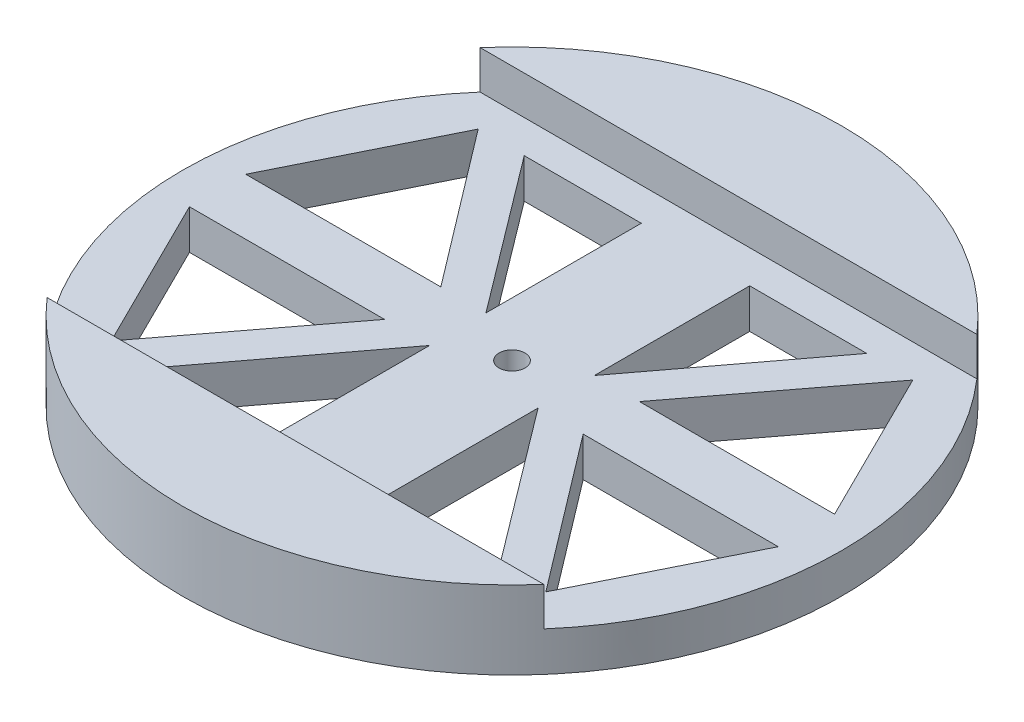
ISO-10303-21;
HEADER;
FILE_DESCRIPTION(('STEP AP214'),'2;1');
FILE_NAME('part.step','',(''),(''),'','','');
FILE_SCHEMA(('AUTOMOTIVE_DESIGN { 1 0 10303 214 1 1 1 1 }'));
ENDSEC;
DATA;
#1=APPLICATION_CONTEXT('core data for automotive mechanical design processes');
#2=APPLICATION_PROTOCOL_DEFINITION('international standard','automotive_design',2000,#1);
#3=PRODUCT_CONTEXT('',#1,'mechanical');
#4=PRODUCT('Part','Part','',(#3));
#5=PRODUCT_RELATED_PRODUCT_CATEGORY('part','',(#4));
#6=PRODUCT_DEFINITION_FORMATION('','',#4);
#7=PRODUCT_DEFINITION_CONTEXT('part definition',#1,'design');
#8=PRODUCT_DEFINITION('design','',#6,#7);
#9=PRODUCT_DEFINITION_SHAPE('','',#8);
#10=(LENGTH_UNIT() NAMED_UNIT(*) SI_UNIT(.MILLI.,.METRE.));
#11=(NAMED_UNIT(*) PLANE_ANGLE_UNIT() SI_UNIT($,.RADIAN.));
#12=(NAMED_UNIT(*) SI_UNIT($,.STERADIAN.) SOLID_ANGLE_UNIT());
#13=UNCERTAINTY_MEASURE_WITH_UNIT(LENGTH_MEASURE(1.E-05),#10,'distance_accuracy_value','');
#14=(GEOMETRIC_REPRESENTATION_CONTEXT(3) GLOBAL_UNCERTAINTY_ASSIGNED_CONTEXT((#13)) GLOBAL_UNIT_ASSIGNED_CONTEXT((#10,
#11,#12)) REPRESENTATION_CONTEXT('',''));
#15=CARTESIAN_POINT('',(0.,0.,0.));
#16=DIRECTION('',(0.,0.,1.));
#17=DIRECTION('',(1.,0.,0.));
#18=AXIS2_PLACEMENT_3D('',#15,#16,#17);
#19=CARTESIAN_POINT('',(0.,18.,0.));
#20=DIRECTION('',(0.,1.,0.));
#21=DIRECTION('',(0.,0.,1.));
#22=AXIS2_PLACEMENT_3D('',#19,#20,#21);
#23=PLANE('',#22);
#24=DIRECTION('',(-1.,0.,0.));
#25=VECTOR('',#24,1.);
#26=CARTESIAN_POINT('',(0.,18.,-49.9317963849467));
#27=LINE('',#26,#25);
#28=CARTESIAN_POINT('',(57.2958611923429,18.,-49.9317963849467));
#29=VERTEX_POINT('',#28);
#30=CARTESIAN_POINT('',(-57.2958611923429,18.,-49.9317963849467));
#31=VERTEX_POINT('',#30);
#32=EDGE_CURVE('E452',#29,#31,#27,.T.);
#33=ORIENTED_EDGE('',*,*,#32,.F.);
#34=CARTESIAN_POINT('',(0.,18.,0.));
#35=DIRECTION('',(0.,1.,0.));
#36=DIRECTION('',(0.,0.,1.));
#37=AXIS2_PLACEMENT_3D('',#34,#35,#36);
#38=CIRCLE('',#37,76.);
#39=EDGE_CURVE('E448',#29,#31,#38,.T.);
#40=ORIENTED_EDGE('',*,*,#39,.T.);
#41=EDGE_LOOP('',(#33,#40));
#42=FACE_BOUND('',#41,.T.);
#43=ADVANCED_FACE('F40',(#42),#23,.T.);
#44=CARTESIAN_POINT('',(0.,18.,0.));
#45=DIRECTION('',(0.,-1.,0.));
#46=DIRECTION('',(0.,0.,-1.));
#47=AXIS2_PLACEMENT_3D('',#44,#45,#46);
#48=CYLINDRICAL_SURFACE('',#47,76.);
#49=ORIENTED_EDGE('',*,*,#39,.F.);
#50=DIRECTION('',(0.,-1.,0.));
#51=VECTOR('',#50,1.);
#52=CARTESIAN_POINT('',(57.2958611923429,18.,-49.9317963849467));
#53=LINE('',#52,#51);
#54=CARTESIAN_POINT('',(57.2958611923429,9.11,-49.9317963849467));
#55=VERTEX_POINT('',#54);
#56=EDGE_CURVE('E441',#29,#55,#53,.T.);
#57=ORIENTED_EDGE('',*,*,#56,.T.);
#58=CARTESIAN_POINT('',(0.,9.11,0.));
#59=DIRECTION('',(0.,1.,0.));
#60=DIRECTION('',(0.,0.,1.));
#61=AXIS2_PLACEMENT_3D('',#58,#59,#60);
#62=CIRCLE('',#61,76.);
#63=CARTESIAN_POINT('',(57.2958611923429,9.11,49.9317963849467));
#64=VERTEX_POINT('',#63);
#65=EDGE_CURVE('E11',#64,#55,#62,.T.);
#66=ORIENTED_EDGE('',*,*,#65,.F.);
#67=DIRECTION('',(0.,-1.,0.));
#68=VECTOR('',#67,1.);
#69=CARTESIAN_POINT('',(57.2958611923429,18.,49.9317963849467));
#70=LINE('',#69,#68);
#71=CARTESIAN_POINT('',(57.2958611923429,18.,49.9317963849467));
#72=VERTEX_POINT('',#71);
#73=EDGE_CURVE('E432',#64,#72,#70,.F.);
#74=ORIENTED_EDGE('',*,*,#73,.T.);
#75=CARTESIAN_POINT('',(-57.2958611923429,18.,49.9317963849467));
#76=VERTEX_POINT('',#75);
#77=EDGE_CURVE('E445',#76,#72,#38,.T.);
#78=ORIENTED_EDGE('',*,*,#77,.F.);
#79=DIRECTION('',(0.,-1.,0.));
#80=VECTOR('',#79,1.);
#81=CARTESIAN_POINT('',(-57.2958611923429,18.,49.9317963849467));
#82=LINE('',#81,#80);
#83=CARTESIAN_POINT('',(-57.2958611923429,9.11,49.9317963849467));
#84=VERTEX_POINT('',#83);
#85=EDGE_CURVE('E435',#76,#84,#82,.T.);
#86=ORIENTED_EDGE('',*,*,#85,.T.);
#87=CARTESIAN_POINT('',(-57.2958611923429,9.11,-49.9317963849467));
#88=VERTEX_POINT('',#87);
#89=EDGE_CURVE('E44',#88,#84,#62,.T.);
#90=ORIENTED_EDGE('',*,*,#89,.F.);
#91=DIRECTION('',(0.,-1.,0.));
#92=VECTOR('',#91,1.);
#93=CARTESIAN_POINT('',(-57.2958611923429,18.,-49.9317963849467));
#94=LINE('',#93,#92);
#95=EDGE_CURVE('E438',#88,#31,#94,.F.);
#96=ORIENTED_EDGE('',*,*,#95,.T.);
#97=EDGE_LOOP('',(#49,#57,#66,#74,#78,#86,#90,#96));
#98=FACE_BOUND('',#97,.T.);
#99=CARTESIAN_POINT('',(0.,0.,0.));
#100=DIRECTION('',(0.,1.,0.));
#101=DIRECTION('',(0.,0.,1.));
#102=AXIS2_PLACEMENT_3D('',#99,#100,#101);
#103=CIRCLE('',#102,76.);
#104=CARTESIAN_POINT('',(0.,0.,76.));
#105=VERTEX_POINT('',#104);
#106=EDGE_CURVE('E444',#105,#105,#103,.T.);
#107=ORIENTED_EDGE('',*,*,#106,.T.);
#108=EDGE_LOOP('',(#107));
#109=FACE_BOUND('',#108,.T.);
#110=ADVANCED_FACE('F42',(#98,#109),#48,.T.);
#111=DIRECTION('',(1.,0.,0.));
#112=VECTOR('',#111,1.);
#113=CARTESIAN_POINT('',(0.,18.,49.9317963849467));
#114=LINE('',#113,#112);
#115=EDGE_CURVE('E451',#76,#72,#114,.T.);
#116=ORIENTED_EDGE('',*,*,#115,.F.);
#117=ORIENTED_EDGE('',*,*,#77,.T.);
#118=EDGE_LOOP('',(#116,#117));
#119=FACE_BOUND('',#118,.T.);
#120=ADVANCED_FACE('F468',(#119),#23,.T.);
#121=CARTESIAN_POINT('',(0.,0.,0.));
#122=DIRECTION('',(0.,1.,0.));
#123=DIRECTION('',(0.,0.,1.));
#124=AXIS2_PLACEMENT_3D('',#121,#122,#123);
#125=PLANE('',#124);
#126=DIRECTION('',(1.,0.,0.));
#127=VECTOR('',#126,1.);
#128=CARTESIAN_POINT('',(-12.5,0.,42.3228493227827));
#129=LINE('',#128,#127);
#130=CARTESIAN_POINT('',(-39.5,0.,42.3228493227827));
#131=VERTEX_POINT('',#130);
#132=CARTESIAN_POINT('',(-12.5,0.,42.3228493227827));
#133=VERTEX_POINT('',#132);
#134=EDGE_CURVE('E55',#131,#133,#129,.T.);
#135=ORIENTED_EDGE('',*,*,#134,.T.);
#136=DIRECTION('',(0.,0.,-1.));
#137=VECTOR('',#136,1.);
#138=CARTESIAN_POINT('',(-12.5,0.,6.49059266367805));
#139=LINE('',#138,#137);
#140=CARTESIAN_POINT('',(-12.5,0.,6.49059266367805));
#141=VERTEX_POINT('',#140);
#142=EDGE_CURVE('E293',#133,#141,#139,.T.);
#143=ORIENTED_EDGE('',*,*,#142,.T.);
#144=DIRECTION('',(-0.601793099843737,0.,0.798652029973296));
#145=VECTOR('',#144,1.);
#146=CARTESIAN_POINT('',(-12.5,0.,6.49059266367805));
#147=LINE('',#146,#145);
#148=EDGE_CURVE('E298',#141,#131,#147,.T.);
#149=ORIENTED_EDGE('',*,*,#148,.T.);
#150=EDGE_LOOP('',(#135,#143,#149));
#151=FACE_BOUND('',#150,.T.);
#152=DIRECTION('',(1.,0.,0.));
#153=VECTOR('',#152,1.);
#154=CARTESIAN_POINT('',(12.5,0.,42.3228493227827));
#155=LINE('',#154,#153);
#156=CARTESIAN_POINT('',(12.5,0.,42.3228493227827));
#157=VERTEX_POINT('',#156);
#158=CARTESIAN_POINT('',(39.5,0.,42.3228493227827));
#159=VERTEX_POINT('',#158);
#160=EDGE_CURVE('E63',#157,#159,#155,.T.);
#161=ORIENTED_EDGE('',*,*,#160,.T.);
#162=DIRECTION('',(-0.601793099843737,0.,-0.798652029973296));
#163=VECTOR('',#162,1.);
#164=CARTESIAN_POINT('',(12.5,0.,6.49059266367805));
#165=LINE('',#164,#163);
#166=CARTESIAN_POINT('',(12.5,0.,6.49059266367805));
#167=VERTEX_POINT('',#166);
#168=EDGE_CURVE('E272',#159,#167,#165,.T.);
#169=ORIENTED_EDGE('',*,*,#168,.T.);
#170=DIRECTION('',(0.,0.,1.));
#171=VECTOR('',#170,1.);
#172=CARTESIAN_POINT('',(12.5,0.,6.49059266367805));
#173=LINE('',#172,#171);
#174=EDGE_CURVE('E277',#167,#157,#173,.T.);
#175=ORIENTED_EDGE('',*,*,#174,.T.);
#176=EDGE_LOOP('',(#161,#169,#175));
#177=FACE_BOUND('',#176,.T.);
#178=DIRECTION('',(-1.,0.,0.));
#179=VECTOR('',#178,1.);
#180=CARTESIAN_POINT('',(12.5,0.,-42.3228493227827));
#181=LINE('',#180,#179);
#182=CARTESIAN_POINT('',(39.5,0.,-42.3228493227827));
#183=VERTEX_POINT('',#182);
#184=CARTESIAN_POINT('',(12.5,0.,-42.3228493227827));
#185=VERTEX_POINT('',#184);
#186=EDGE_CURVE('E253',#183,#185,#181,.T.);
#187=ORIENTED_EDGE('',*,*,#186,.T.);
#188=DIRECTION('',(0.,0.,1.));
#189=VECTOR('',#188,1.);
#190=CARTESIAN_POINT('',(12.5,0.,-6.49059266367805));
#191=LINE('',#190,#189);
#192=CARTESIAN_POINT('',(12.5,0.,-6.49059266367805));
#193=VERTEX_POINT('',#192);
#194=EDGE_CURVE('E230',#185,#193,#191,.T.);
#195=ORIENTED_EDGE('',*,*,#194,.T.);
#196=DIRECTION('',(0.601793099843737,0.,-0.798652029973296));
#197=VECTOR('',#196,1.);
#198=CARTESIAN_POINT('',(12.5,0.,-6.49059266367805));
#199=LINE('',#198,#197);
#200=EDGE_CURVE('E255',#193,#183,#199,.T.);
#201=ORIENTED_EDGE('',*,*,#200,.T.);
#202=EDGE_LOOP('',(#187,#195,#201));
#203=FACE_BOUND('',#202,.T.);
#204=DIRECTION('',(-1.,0.,0.));
#205=VECTOR('',#204,1.);
#206=CARTESIAN_POINT('',(-12.5,0.,-42.3228493227827));
#207=LINE('',#206,#205);
#208=CARTESIAN_POINT('',(-12.5,0.,-42.3228493227827));
#209=VERTEX_POINT('',#208);
#210=CARTESIAN_POINT('',(-39.5,0.,-42.3228493227827));
#211=VERTEX_POINT('',#210);
#212=EDGE_CURVE('E310',#209,#211,#207,.T.);
#213=ORIENTED_EDGE('',*,*,#212,.T.);
#214=DIRECTION('',(0.601793099843737,0.,0.798652029973296));
#215=VECTOR('',#214,1.);
#216=CARTESIAN_POINT('',(-12.5,0.,-6.49059266367805));
#217=LINE('',#216,#215);
#218=CARTESIAN_POINT('',(-12.5,0.,-6.49059266367805));
#219=VERTEX_POINT('',#218);
#220=EDGE_CURVE('E303',#211,#219,#217,.T.);
#221=ORIENTED_EDGE('',*,*,#220,.T.);
#222=DIRECTION('',(0.,0.,-1.));
#223=VECTOR('',#222,1.);
#224=CARTESIAN_POINT('',(-12.5,0.,-6.49059266367805));
#225=LINE('',#224,#223);
#226=EDGE_CURVE('E306',#219,#209,#225,.T.);
#227=ORIENTED_EDGE('',*,*,#226,.T.);
#228=EDGE_LOOP('',(#213,#221,#227));
#229=FACE_BOUND('',#228,.T.);
#230=DIRECTION('',(-1.,0.,0.));
#231=VECTOR('',#230,1.);
#232=CARTESIAN_POINT('',(-67.902913425769,0.,6.49059266367802));
#233=LINE('',#232,#231);
#234=CARTESIAN_POINT('',(-22.902913425769,0.,6.49059266367803));
#235=VERTEX_POINT('',#234);
#236=CARTESIAN_POINT('',(-67.902913425769,0.,6.49059266367802));
#237=VERTEX_POINT('',#236);
#238=EDGE_CURVE('E378',#235,#237,#233,.T.);
#239=ORIENTED_EDGE('',*,*,#238,.T.);
#240=DIRECTION('',(0.444444444444444,0.,0.895806416477617));
#241=VECTOR('',#240,1.);
#242=CARTESIAN_POINT('',(-50.1251356479912,0.,42.3228493227827));
#243=LINE('',#242,#241);
#244=CARTESIAN_POINT('',(-50.1251356479912,0.,42.3228493227827));
#245=VERTEX_POINT('',#244);
#246=EDGE_CURVE('E386',#237,#245,#243,.T.);
#247=ORIENTED_EDGE('',*,*,#246,.T.);
#248=DIRECTION('',(0.604938271604938,0.,-0.796272370202326));
#249=VECTOR('',#248,1.);
#250=CARTESIAN_POINT('',(-22.902913425769,0.,6.49059266367803));
#251=LINE('',#250,#249);
#252=EDGE_CURVE('E392',#245,#235,#251,.T.);
#253=ORIENTED_EDGE('',*,*,#252,.T.);
#254=EDGE_LOOP('',(#239,#247,#253));
#255=FACE_BOUND('',#254,.T.);
#256=DIRECTION('',(-1.,0.,0.));
#257=VECTOR('',#256,1.);
#258=CARTESIAN_POINT('',(67.902913425769,0.,6.49059266367803));
#259=LINE('',#258,#257);
#260=CARTESIAN_POINT('',(67.9029134257689,0.,6.49059266367804));
#261=VERTEX_POINT('',#260);
#262=CARTESIAN_POINT('',(22.902913425769,0.,6.49059266367804));
#263=VERTEX_POINT('',#262);
#264=EDGE_CURVE('E354',#261,#263,#259,.T.);
#265=ORIENTED_EDGE('',*,*,#264,.T.);
#266=DIRECTION('',(0.604938271604938,0.,0.796272370202326));
#267=VECTOR('',#266,1.);
#268=CARTESIAN_POINT('',(22.902913425769,0.,6.49059266367804));
#269=LINE('',#268,#267);
#270=CARTESIAN_POINT('',(50.1251356479912,0.,42.3228493227827));
#271=VERTEX_POINT('',#270);
#272=EDGE_CURVE('E364',#263,#271,#269,.T.);
#273=ORIENTED_EDGE('',*,*,#272,.T.);
#274=DIRECTION('',(0.444444444444444,0.,-0.895806416477617));
#275=VECTOR('',#274,1.);
#276=CARTESIAN_POINT('',(50.1251356479912,0.,42.3228493227827));
#277=LINE('',#276,#275);
#278=EDGE_CURVE('E370',#271,#261,#277,.T.);
#279=ORIENTED_EDGE('',*,*,#278,.T.);
#280=EDGE_LOOP('',(#265,#273,#279));
#281=FACE_BOUND('',#280,.T.);
#282=DIRECTION('',(1.,0.,0.));
#283=VECTOR('',#282,1.);
#284=CARTESIAN_POINT('',(67.902913425769,0.,-6.49059266367803));
#285=LINE('',#284,#283);
#286=CARTESIAN_POINT('',(22.902913425769,0.,-6.49059266367804));
#287=VERTEX_POINT('',#286);
#288=CARTESIAN_POINT('',(67.902913425769,0.,-6.49059266367803));
#289=VERTEX_POINT('',#288);
#290=EDGE_CURVE('E328',#287,#289,#285,.T.);
#291=ORIENTED_EDGE('',*,*,#290,.T.);
#292=DIRECTION('',(-0.444444444444444,0.,-0.895806416477617));
#293=VECTOR('',#292,1.);
#294=CARTESIAN_POINT('',(50.1251356479912,0.,-42.3228493227827));
#295=LINE('',#294,#293);
#296=CARTESIAN_POINT('',(50.1251356479912,0.,-42.3228493227827));
#297=VERTEX_POINT('',#296);
#298=EDGE_CURVE('E338',#289,#297,#295,.T.);
#299=ORIENTED_EDGE('',*,*,#298,.T.);
#300=DIRECTION('',(-0.604938271604938,0.,0.796272370202326));
#301=VECTOR('',#300,1.);
#302=CARTESIAN_POINT('',(22.902913425769,0.,-6.49059266367804));
#303=LINE('',#302,#301);
#304=EDGE_CURVE('E346',#297,#287,#303,.T.);
#305=ORIENTED_EDGE('',*,*,#304,.T.);
#306=EDGE_LOOP('',(#291,#299,#305));
#307=FACE_BOUND('',#306,.T.);
#308=DIRECTION('',(1.,0.,0.));
#309=VECTOR('',#308,1.);
#310=CARTESIAN_POINT('',(-67.902913425769,0.,-6.49059266367803));
#311=LINE('',#310,#309);
#312=CARTESIAN_POINT('',(-67.902913425769,0.,-6.49059266367803));
#313=VERTEX_POINT('',#312);
#314=CARTESIAN_POINT('',(-22.902913425769,0.,-6.49059266367803));
#315=VERTEX_POINT('',#314);
#316=EDGE_CURVE('E404',#313,#315,#311,.T.);
#317=ORIENTED_EDGE('',*,*,#316,.T.);
#318=DIRECTION('',(-0.604938271604938,0.,-0.796272370202326));
#319=VECTOR('',#318,1.);
#320=CARTESIAN_POINT('',(-22.902913425769,0.,-6.49059266367803));
#321=LINE('',#320,#319);
#322=CARTESIAN_POINT('',(-50.1251356479912,0.,-42.3228493227827));
#323=VERTEX_POINT('',#322);
#324=EDGE_CURVE('E397',#315,#323,#321,.T.);
#325=ORIENTED_EDGE('',*,*,#324,.T.);
#326=DIRECTION('',(-0.444444444444444,0.,0.895806416477617));
#327=VECTOR('',#326,1.);
#328=CARTESIAN_POINT('',(-50.1251356479912,0.,-42.3228493227827));
#329=LINE('',#328,#327);
#330=EDGE_CURVE('E400',#323,#313,#329,.T.);
#331=ORIENTED_EDGE('',*,*,#330,.T.);
#332=EDGE_LOOP('',(#317,#325,#331));
#333=FACE_BOUND('',#332,.T.);
#334=CARTESIAN_POINT('',(0.,0.,0.));
#335=DIRECTION('',(0.,1.,0.));
#336=DIRECTION('',(0.,0.,1.));
#337=AXIS2_PLACEMENT_3D('',#334,#335,#336);
#338=CIRCLE('',#337,3.);
#339=CARTESIAN_POINT('',(0.,0.,3.));
#340=VERTEX_POINT('',#339);
#341=EDGE_CURVE('E423',#340,#340,#338,.T.);
#342=ORIENTED_EDGE('',*,*,#341,.T.);
#343=EDGE_LOOP('',(#342));
#344=FACE_BOUND('',#343,.T.);
#345=ORIENTED_EDGE('',*,*,#106,.F.);
#346=EDGE_LOOP('',(#345));
#347=FACE_BOUND('',#346,.T.);
#348=ADVANCED_FACE('F470',(#151,#177,#203,#229,#255,#281,#307,#333,#344,#347),#125,.F.);
#349=CARTESIAN_POINT('',(-58.0079555223723,9.11,0.));
#350=DIRECTION('',(0.,1.,0.));
#351=DIRECTION('',(0.,0.,1.));
#352=AXIS2_PLACEMENT_3D('',#349,#350,#351);
#353=PLANE('',#352);
#354=DIRECTION('',(0.,0.,-1.));
#355=VECTOR('',#354,1.);
#356=CARTESIAN_POINT('',(-12.5,9.11,6.49059266367805));
#357=LINE('',#356,#355);
#358=CARTESIAN_POINT('',(-12.5,9.11,42.3228493227827));
#359=VERTEX_POINT('',#358);
#360=CARTESIAN_POINT('',(-12.5,9.11,6.49059266367805));
#361=VERTEX_POINT('',#360);
#362=EDGE_CURVE('E267',#359,#361,#357,.T.);
#363=ORIENTED_EDGE('',*,*,#362,.F.);
#364=DIRECTION('',(1.,0.,0.));
#365=VECTOR('',#364,1.);
#366=CARTESIAN_POINT('',(-12.5,9.11,42.3228493227827));
#367=LINE('',#366,#365);
#368=CARTESIAN_POINT('',(-39.5,9.11,42.3228493227827));
#369=VERTEX_POINT('',#368);
#370=EDGE_CURVE('E289',#369,#359,#367,.T.);
#371=ORIENTED_EDGE('',*,*,#370,.F.);
#372=DIRECTION('',(-0.601793099843737,0.,0.798652029973296));
#373=VECTOR('',#372,1.);
#374=CARTESIAN_POINT('',(-12.5,9.11,6.49059266367805));
#375=LINE('',#374,#373);
#376=EDGE_CURVE('E292',#361,#369,#375,.T.);
#377=ORIENTED_EDGE('',*,*,#376,.F.);
#378=EDGE_LOOP('',(#363,#371,#377));
#379=FACE_BOUND('',#378,.T.);
#380=DIRECTION('',(-0.601793099843737,0.,-0.798652029973296));
#381=VECTOR('',#380,1.);
#382=CARTESIAN_POINT('',(12.5,9.11,6.49059266367805));
#383=LINE('',#382,#381);
#384=CARTESIAN_POINT('',(39.5,9.11,42.3228493227827));
#385=VERTEX_POINT('',#384);
#386=CARTESIAN_POINT('',(12.5,9.11,6.49059266367805));
#387=VERTEX_POINT('',#386);
#388=EDGE_CURVE('E234',#385,#387,#383,.T.);
#389=ORIENTED_EDGE('',*,*,#388,.F.);
#390=DIRECTION('',(1.,0.,0.));
#391=VECTOR('',#390,1.);
#392=CARTESIAN_POINT('',(12.5,9.11,42.3228493227827));
#393=LINE('',#392,#391);
#394=CARTESIAN_POINT('',(12.5,9.11,42.3228493227827));
#395=VERTEX_POINT('',#394);
#396=EDGE_CURVE('E268',#395,#385,#393,.T.);
#397=ORIENTED_EDGE('',*,*,#396,.F.);
#398=DIRECTION('',(0.,0.,1.));
#399=VECTOR('',#398,1.);
#400=CARTESIAN_POINT('',(12.5,9.11,6.49059266367805));
#401=LINE('',#400,#399);
#402=EDGE_CURVE('E271',#387,#395,#401,.T.);
#403=ORIENTED_EDGE('',*,*,#402,.F.);
#404=EDGE_LOOP('',(#389,#397,#403));
#405=FACE_BOUND('',#404,.T.);
#406=DIRECTION('',(0.,0.,1.));
#407=VECTOR('',#406,1.);
#408=CARTESIAN_POINT('',(12.5,9.11,-6.49059266367805));
#409=LINE('',#408,#407);
#410=CARTESIAN_POINT('',(12.5,9.11,-42.3228493227827));
#411=VERTEX_POINT('',#410);
#412=CARTESIAN_POINT('',(12.5,9.11,-6.49059266367805));
#413=VERTEX_POINT('',#412);
#414=EDGE_CURVE('E227',#411,#413,#409,.T.);
#415=ORIENTED_EDGE('',*,*,#414,.F.);
#416=DIRECTION('',(-1.,0.,0.));
#417=VECTOR('',#416,1.);
#418=CARTESIAN_POINT('',(12.5,9.11,-42.3228493227827));
#419=LINE('',#418,#417);
#420=CARTESIAN_POINT('',(39.5,9.11,-42.3228493227827));
#421=VERTEX_POINT('',#420);
#422=EDGE_CURVE('E237',#421,#411,#419,.T.);
#423=ORIENTED_EDGE('',*,*,#422,.F.);
#424=DIRECTION('',(0.601793099843737,0.,-0.798652029973296));
#425=VECTOR('',#424,1.);
#426=CARTESIAN_POINT('',(12.5,9.11,-6.49059266367805));
#427=LINE('',#426,#425);
#428=EDGE_CURVE('E243',#413,#421,#427,.T.);
#429=ORIENTED_EDGE('',*,*,#428,.F.);
#430=EDGE_LOOP('',(#415,#423,#429));
#431=FACE_BOUND('',#430,.T.);
#432=DIRECTION('',(0.601793099843737,0.,0.798652029973296));
#433=VECTOR('',#432,1.);
#434=CARTESIAN_POINT('',(-12.5,9.11,-6.49059266367805));
#435=LINE('',#434,#433);
#436=CARTESIAN_POINT('',(-39.5,9.11,-42.3228493227827));
#437=VERTEX_POINT('',#436);
#438=CARTESIAN_POINT('',(-12.5,9.11,-6.49059266367805));
#439=VERTEX_POINT('',#438);
#440=EDGE_CURVE('E247',#437,#439,#435,.T.);
#441=ORIENTED_EDGE('',*,*,#440,.F.);
#442=DIRECTION('',(-1.,0.,0.));
#443=VECTOR('',#442,1.);
#444=CARTESIAN_POINT('',(-12.5,9.11,-42.3228493227827));
#445=LINE('',#444,#443);
#446=CARTESIAN_POINT('',(-12.5,9.11,-42.3228493227827));
#447=VERTEX_POINT('',#446);
#448=EDGE_CURVE('E307',#447,#437,#445,.T.);
#449=ORIENTED_EDGE('',*,*,#448,.F.);
#450=DIRECTION('',(0.,0.,-1.));
#451=VECTOR('',#450,1.);
#452=CARTESIAN_POINT('',(-12.5,9.11,-6.49059266367805));
#453=LINE('',#452,#451);
#454=EDGE_CURVE('E249',#439,#447,#453,.T.);
#455=ORIENTED_EDGE('',*,*,#454,.F.);
#456=EDGE_LOOP('',(#441,#449,#455));
#457=FACE_BOUND('',#456,.T.);
#458=DIRECTION('',(0.444444444444444,0.,0.895806416477617));
#459=VECTOR('',#458,1.);
#460=CARTESIAN_POINT('',(-50.1251356479912,9.11,42.3228493227827));
#461=LINE('',#460,#459);
#462=CARTESIAN_POINT('',(-67.902913425769,9.11,6.49059266367802));
#463=VERTEX_POINT('',#462);
#464=CARTESIAN_POINT('',(-50.1251356479912,9.11,42.3228493227827));
#465=VERTEX_POINT('',#464);
#466=EDGE_CURVE('E359',#463,#465,#461,.T.);
#467=ORIENTED_EDGE('',*,*,#466,.F.);
#468=DIRECTION('',(-1.,0.,0.));
#469=VECTOR('',#468,1.);
#470=CARTESIAN_POINT('',(-67.902913425769,9.11,6.49059266367802));
#471=LINE('',#470,#469);
#472=CARTESIAN_POINT('',(-22.902913425769,9.11,6.49059266367803));
#473=VERTEX_POINT('',#472);
#474=EDGE_CURVE('E382',#473,#463,#471,.T.);
#475=ORIENTED_EDGE('',*,*,#474,.F.);
#476=DIRECTION('',(0.604938271604938,0.,-0.796272370202326));
#477=VECTOR('',#476,1.);
#478=CARTESIAN_POINT('',(-22.902913425769,9.11,6.49059266367803));
#479=LINE('',#478,#477);
#480=EDGE_CURVE('E385',#465,#473,#479,.T.);
#481=ORIENTED_EDGE('',*,*,#480,.F.);
#482=EDGE_LOOP('',(#467,#475,#481));
#483=FACE_BOUND('',#482,.T.);
#484=DIRECTION('',(0.604938271604938,0.,0.796272370202326));
#485=VECTOR('',#484,1.);
#486=CARTESIAN_POINT('',(22.902913425769,9.11,6.49059266367804));
#487=LINE('',#486,#485);
#488=CARTESIAN_POINT('',(22.902913425769,9.11,6.49059266367804));
#489=VERTEX_POINT('',#488);
#490=CARTESIAN_POINT('',(50.1251356479912,9.11,42.3228493227827));
#491=VERTEX_POINT('',#490);
#492=EDGE_CURVE('E333',#489,#491,#487,.T.);
#493=ORIENTED_EDGE('',*,*,#492,.F.);
#494=DIRECTION('',(-1.,0.,0.));
#495=VECTOR('',#494,1.);
#496=CARTESIAN_POINT('',(67.902913425769,9.11,6.49059266367803));
#497=LINE('',#496,#495);
#498=CARTESIAN_POINT('',(67.902913425769,9.11,6.49059266367803));
#499=VERTEX_POINT('',#498);
#500=EDGE_CURVE('E360',#499,#489,#497,.T.);
#501=ORIENTED_EDGE('',*,*,#500,.F.);
#502=DIRECTION('',(0.444444444444444,0.,-0.895806416477617));
#503=VECTOR('',#502,1.);
#504=CARTESIAN_POINT('',(50.1251356479912,9.11,42.3228493227827));
#505=LINE('',#504,#503);
#506=EDGE_CURVE('E363',#491,#499,#505,.T.);
#507=ORIENTED_EDGE('',*,*,#506,.F.);
#508=EDGE_LOOP('',(#493,#501,#507));
#509=FACE_BOUND('',#508,.T.);
#510=DIRECTION('',(-0.444444444444444,0.,-0.895806416477617));
#511=VECTOR('',#510,1.);
#512=CARTESIAN_POINT('',(50.1251356479912,9.11,-42.3228493227827));
#513=LINE('',#512,#511);
#514=CARTESIAN_POINT('',(67.902913425769,9.11,-6.49059266367803));
#515=VERTEX_POINT('',#514);
#516=CARTESIAN_POINT('',(50.1251356479912,9.11,-42.3228493227827));
#517=VERTEX_POINT('',#516);
#518=EDGE_CURVE('E341',#515,#517,#513,.T.);
#519=ORIENTED_EDGE('',*,*,#518,.F.);
#520=DIRECTION('',(1.,0.,0.));
#521=VECTOR('',#520,1.);
#522=CARTESIAN_POINT('',(67.902913425769,9.11,-6.49059266367803));
#523=LINE('',#522,#521);
#524=CARTESIAN_POINT('',(22.902913425769,9.11,-6.49059266367804));
#525=VERTEX_POINT('',#524);
#526=EDGE_CURVE('E334',#525,#515,#523,.T.);
#527=ORIENTED_EDGE('',*,*,#526,.F.);
#528=DIRECTION('',(-0.604938271604938,0.,0.796272370202326));
#529=VECTOR('',#528,1.);
#530=CARTESIAN_POINT('',(22.902913425769,9.11,-6.49059266367804));
#531=LINE('',#530,#529);
#532=EDGE_CURVE('E337',#517,#525,#531,.T.);
#533=ORIENTED_EDGE('',*,*,#532,.F.);
#534=EDGE_LOOP('',(#519,#527,#533));
#535=FACE_BOUND('',#534,.T.);
#536=DIRECTION('',(-0.604938271604938,0.,-0.796272370202326));
#537=VECTOR('',#536,1.);
#538=CARTESIAN_POINT('',(-22.902913425769,9.11,-6.49059266367803));
#539=LINE('',#538,#537);
#540=CARTESIAN_POINT('',(-22.902913425769,9.11,-6.49059266367803));
#541=VERTEX_POINT('',#540);
#542=CARTESIAN_POINT('',(-50.1251356479912,9.11,-42.3228493227827));
#543=VERTEX_POINT('',#542);
#544=EDGE_CURVE('E343',#541,#543,#539,.T.);
#545=ORIENTED_EDGE('',*,*,#544,.F.);
#546=DIRECTION('',(1.,0.,0.));
#547=VECTOR('',#546,1.);
#548=CARTESIAN_POINT('',(-67.902913425769,9.11,-6.49059266367803));
#549=LINE('',#548,#547);
#550=CARTESIAN_POINT('',(-67.902913425769,9.11,-6.49059266367803));
#551=VERTEX_POINT('',#550);
#552=EDGE_CURVE('E401',#551,#541,#549,.T.);
#553=ORIENTED_EDGE('',*,*,#552,.F.);
#554=DIRECTION('',(-0.444444444444444,0.,0.895806416477617));
#555=VECTOR('',#554,1.);
#556=CARTESIAN_POINT('',(-50.1251356479912,9.11,-42.3228493227827));
#557=LINE('',#556,#555);
#558=EDGE_CURVE('E409',#543,#551,#557,.T.);
#559=ORIENTED_EDGE('',*,*,#558,.F.);
#560=EDGE_LOOP('',(#545,#553,#559));
#561=FACE_BOUND('',#560,.T.);
#562=CARTESIAN_POINT('',(0.,9.11,0.));
#563=DIRECTION('',(0.,1.,0.));
#564=DIRECTION('',(0.,0.,1.));
#565=AXIS2_PLACEMENT_3D('',#562,#563,#564);
#566=CIRCLE('',#565,3.);
#567=CARTESIAN_POINT('',(0.,9.11,3.));
#568=VERTEX_POINT('',#567);
#569=EDGE_CURVE('E416',#568,#568,#566,.T.);
#570=ORIENTED_EDGE('',*,*,#569,.F.);
#571=EDGE_LOOP('',(#570));
#572=FACE_BOUND('',#571,.T.);
#573=ORIENTED_EDGE('',*,*,#65,.T.);
#574=DIRECTION('',(-1.,0.,0.));
#575=VECTOR('',#574,1.);
#576=CARTESIAN_POINT('',(-58.0079555223723,9.11,-49.9317963849467));
#577=LINE('',#576,#575);
#578=EDGE_CURVE('E429',#55,#88,#577,.T.);
#579=ORIENTED_EDGE('',*,*,#578,.T.);
#580=ORIENTED_EDGE('',*,*,#89,.T.);
#581=DIRECTION('',(1.,0.,0.));
#582=VECTOR('',#581,1.);
#583=CARTESIAN_POINT('',(-58.0079555223723,9.11,49.9317963849467));
#584=LINE('',#583,#582);
#585=EDGE_CURVE('E426',#84,#64,#584,.T.);
#586=ORIENTED_EDGE('',*,*,#585,.T.);
#587=EDGE_LOOP('',(#573,#579,#580,#586));
#588=FACE_BOUND('',#587,.T.);
#589=ADVANCED_FACE('F245',(#379,#405,#431,#457,#483,#509,#535,#561,#572,#588),#353,.T.);
#590=CARTESIAN_POINT('',(-58.0079555223723,9.11,-49.9317963849467));
#591=DIRECTION('',(0.,0.,-1.));
#592=DIRECTION('',(-1.,0.,0.));
#593=AXIS2_PLACEMENT_3D('',#590,#591,#592);
#594=PLANE('',#593);
#595=ORIENTED_EDGE('',*,*,#32,.T.);
#596=ORIENTED_EDGE('',*,*,#95,.F.);
#597=ORIENTED_EDGE('',*,*,#578,.F.);
#598=ORIENTED_EDGE('',*,*,#56,.F.);
#599=EDGE_LOOP('',(#595,#596,#597,#598));
#600=FACE_BOUND('',#599,.T.);
#601=ADVANCED_FACE('F484',(#600),#594,.F.);
#602=CARTESIAN_POINT('',(-58.0079555223723,9.11,49.9317963849467));
#603=DIRECTION('',(0.,0.,1.));
#604=DIRECTION('',(1.,0.,0.));
#605=AXIS2_PLACEMENT_3D('',#602,#603,#604);
#606=PLANE('',#605);
#607=ORIENTED_EDGE('',*,*,#115,.T.);
#608=ORIENTED_EDGE('',*,*,#73,.F.);
#609=ORIENTED_EDGE('',*,*,#585,.F.);
#610=ORIENTED_EDGE('',*,*,#85,.F.);
#611=EDGE_LOOP('',(#607,#608,#609,#610));
#612=FACE_BOUND('',#611,.T.);
#613=ADVANCED_FACE('F462',(#612),#606,.F.);
#614=CARTESIAN_POINT('',(0.,-10.89,0.));
#615=DIRECTION('',(0.,1.,0.));
#616=DIRECTION('',(0.,0.,1.));
#617=AXIS2_PLACEMENT_3D('',#614,#615,#616);
#618=CYLINDRICAL_SURFACE('',#617,3.);
#619=ORIENTED_EDGE('',*,*,#569,.T.);
#620=EDGE_LOOP('',(#619));
#621=FACE_BOUND('',#620,.T.);
#622=ORIENTED_EDGE('',*,*,#341,.F.);
#623=EDGE_LOOP('',(#622));
#624=FACE_BOUND('',#623,.T.);
#625=ADVANCED_FACE('F489',(#621,#624),#618,.F.);
#626=CARTESIAN_POINT('',(-22.902913425769,0.,-6.49059266367803));
#627=DIRECTION('',(0.796272370202326,0.,-0.604938271604938));
#628=DIRECTION('',(-0.604938271604938,0.,-0.796272370202326));
#629=AXIS2_PLACEMENT_3D('',#626,#627,#628);
#630=PLANE('',#629);
#631=ORIENTED_EDGE('',*,*,#544,.T.);
#632=DIRECTION('',(0.,1.,0.));
#633=VECTOR('',#632,1.);
#634=CARTESIAN_POINT('',(-50.1251356479912,0.,-42.3228493227827));
#635=LINE('',#634,#633);
#636=EDGE_CURVE('E407',#323,#543,#635,.T.);
#637=ORIENTED_EDGE('',*,*,#636,.F.);
#638=ORIENTED_EDGE('',*,*,#324,.F.);
#639=DIRECTION('',(0.,1.,0.));
#640=VECTOR('',#639,1.);
#641=CARTESIAN_POINT('',(-22.902913425769,0.,-6.49059266367803));
#642=LINE('',#641,#640);
#643=EDGE_CURVE('E414',#315,#541,#642,.T.);
#644=ORIENTED_EDGE('',*,*,#643,.T.);
#645=EDGE_LOOP('',(#631,#637,#638,#644));
#646=FACE_BOUND('',#645,.T.);
#647=ADVANCED_FACE('F496',(#646),#630,.F.);
#648=CARTESIAN_POINT('',(-67.902913425769,0.,-6.49059266367803));
#649=DIRECTION('',(0.,0.,1.));
#650=DIRECTION('',(1.,0.,0.));
#651=AXIS2_PLACEMENT_3D('',#648,#649,#650);
#652=PLANE('',#651);
#653=ORIENTED_EDGE('',*,*,#552,.T.);
#654=ORIENTED_EDGE('',*,*,#643,.F.);
#655=ORIENTED_EDGE('',*,*,#316,.F.);
#656=DIRECTION('',(0.,1.,0.));
#657=VECTOR('',#656,1.);
#658=CARTESIAN_POINT('',(-67.902913425769,0.,-6.49059266367803));
#659=LINE('',#658,#657);
#660=EDGE_CURVE('E417',#313,#551,#659,.T.);
#661=ORIENTED_EDGE('',*,*,#660,.T.);
#662=EDGE_LOOP('',(#653,#654,#655,#661));
#663=FACE_BOUND('',#662,.T.);
#664=ADVANCED_FACE('F500',(#663),#652,.F.);
#665=CARTESIAN_POINT('',(-50.1251356479912,0.,-42.3228493227827));
#666=DIRECTION('',(-0.895806416477617,0.,-0.444444444444444));
#667=DIRECTION('',(-0.444444444444444,0.,0.895806416477617));
#668=AXIS2_PLACEMENT_3D('',#665,#666,#667);
#669=PLANE('',#668);
#670=ORIENTED_EDGE('',*,*,#558,.T.);
#671=ORIENTED_EDGE('',*,*,#660,.F.);
#672=ORIENTED_EDGE('',*,*,#330,.F.);
#673=ORIENTED_EDGE('',*,*,#636,.T.);
#674=EDGE_LOOP('',(#670,#671,#672,#673));
#675=FACE_BOUND('',#674,.T.);
#676=ADVANCED_FACE('F502',(#675),#669,.F.);
#677=CARTESIAN_POINT('',(50.1251356479912,0.,-42.3228493227827));
#678=DIRECTION('',(0.895806416477617,0.,-0.444444444444444));
#679=DIRECTION('',(-0.444444444444444,0.,-0.895806416477617));
#680=AXIS2_PLACEMENT_3D('',#677,#678,#679);
#681=PLANE('',#680);
#682=ORIENTED_EDGE('',*,*,#518,.T.);
#683=DIRECTION('',(0.,1.,0.));
#684=VECTOR('',#683,1.);
#685=CARTESIAN_POINT('',(50.1251356479912,0.,-42.3228493227827));
#686=LINE('',#685,#684);
#687=EDGE_CURVE('E325',#297,#517,#686,.T.);
#688=ORIENTED_EDGE('',*,*,#687,.F.);
#689=ORIENTED_EDGE('',*,*,#298,.F.);
#690=DIRECTION('',(0.,1.,0.));
#691=VECTOR('',#690,1.);
#692=CARTESIAN_POINT('',(67.902913425769,0.,-6.49059266367803));
#693=LINE('',#692,#691);
#694=EDGE_CURVE('E331',#289,#515,#693,.T.);
#695=ORIENTED_EDGE('',*,*,#694,.T.);
#696=EDGE_LOOP('',(#682,#688,#689,#695));
#697=FACE_BOUND('',#696,.T.);
#698=ADVANCED_FACE('F505',(#697),#681,.F.);
#699=CARTESIAN_POINT('',(67.902913425769,0.,-6.49059266367803));
#700=DIRECTION('',(0.,0.,1.));
#701=DIRECTION('',(1.,0.,0.));
#702=AXIS2_PLACEMENT_3D('',#699,#700,#701);
#703=PLANE('',#702);
#704=ORIENTED_EDGE('',*,*,#526,.T.);
#705=ORIENTED_EDGE('',*,*,#694,.F.);
#706=ORIENTED_EDGE('',*,*,#290,.F.);
#707=DIRECTION('',(0.,1.,0.));
#708=VECTOR('',#707,1.);
#709=CARTESIAN_POINT('',(22.902913425769,0.,-6.49059266367804));
#710=LINE('',#709,#708);
#711=EDGE_CURVE('E329',#287,#525,#710,.T.);
#712=ORIENTED_EDGE('',*,*,#711,.T.);
#713=EDGE_LOOP('',(#704,#705,#706,#712));
#714=FACE_BOUND('',#713,.T.);
#715=ADVANCED_FACE('F536',(#714),#703,.F.);
#716=CARTESIAN_POINT('',(22.902913425769,0.,-6.49059266367804));
#717=DIRECTION('',(-0.796272370202326,0.,-0.604938271604938));
#718=DIRECTION('',(-0.604938271604938,0.,0.796272370202326));
#719=AXIS2_PLACEMENT_3D('',#716,#717,#718);
#720=PLANE('',#719);
#721=ORIENTED_EDGE('',*,*,#532,.T.);
#722=ORIENTED_EDGE('',*,*,#711,.F.);
#723=ORIENTED_EDGE('',*,*,#304,.F.);
#724=ORIENTED_EDGE('',*,*,#687,.T.);
#725=EDGE_LOOP('',(#721,#722,#723,#724));
#726=FACE_BOUND('',#725,.T.);
#727=ADVANCED_FACE('F534',(#726),#720,.F.);
#728=CARTESIAN_POINT('',(22.902913425769,0.,6.49059266367804));
#729=DIRECTION('',(-0.796272370202326,0.,0.604938271604938));
#730=DIRECTION('',(0.604938271604938,0.,0.796272370202326));
#731=AXIS2_PLACEMENT_3D('',#728,#729,#730);
#732=PLANE('',#731);
#733=ORIENTED_EDGE('',*,*,#492,.T.);
#734=DIRECTION('',(0.,1.,0.));
#735=VECTOR('',#734,1.);
#736=CARTESIAN_POINT('',(50.1251356479912,0.,42.3228493227827));
#737=LINE('',#736,#735);
#738=EDGE_CURVE('E351',#271,#491,#737,.T.);
#739=ORIENTED_EDGE('',*,*,#738,.F.);
#740=ORIENTED_EDGE('',*,*,#272,.F.);
#741=DIRECTION('',(0.,1.,0.));
#742=VECTOR('',#741,1.);
#743=CARTESIAN_POINT('',(22.902913425769,0.,6.49059266367804));
#744=LINE('',#743,#742);
#745=EDGE_CURVE('E357',#263,#489,#744,.T.);
#746=ORIENTED_EDGE('',*,*,#745,.T.);
#747=EDGE_LOOP('',(#733,#739,#740,#746));
#748=FACE_BOUND('',#747,.T.);
#749=ADVANCED_FACE('F527',(#748),#732,.F.);
#750=CARTESIAN_POINT('',(67.902913425769,0.,6.49059266367803));
#751=DIRECTION('',(0.,0.,-1.));
#752=DIRECTION('',(-1.,0.,0.));
#753=AXIS2_PLACEMENT_3D('',#750,#751,#752);
#754=PLANE('',#753);
#755=ORIENTED_EDGE('',*,*,#500,.T.);
#756=ORIENTED_EDGE('',*,*,#745,.F.);
#757=ORIENTED_EDGE('',*,*,#264,.F.);
#758=DIRECTION('',(0.,1.,0.));
#759=VECTOR('',#758,1.);
#760=CARTESIAN_POINT('',(67.902913425769,0.,6.49059266367803));
#761=LINE('',#760,#759);
#762=EDGE_CURVE('E355',#261,#499,#761,.T.);
#763=ORIENTED_EDGE('',*,*,#762,.T.);
#764=EDGE_LOOP('',(#755,#756,#757,#763));
#765=FACE_BOUND('',#764,.T.);
#766=ADVANCED_FACE('F524',(#765),#754,.F.);
#767=CARTESIAN_POINT('',(50.1251356479912,0.,42.3228493227827));
#768=DIRECTION('',(0.895806416477617,0.,0.444444444444444));
#769=DIRECTION('',(0.444444444444444,0.,-0.895806416477617));
#770=AXIS2_PLACEMENT_3D('',#767,#768,#769);
#771=PLANE('',#770);
#772=ORIENTED_EDGE('',*,*,#506,.T.);
#773=ORIENTED_EDGE('',*,*,#762,.F.);
#774=ORIENTED_EDGE('',*,*,#278,.F.);
#775=ORIENTED_EDGE('',*,*,#738,.T.);
#776=EDGE_LOOP('',(#772,#773,#774,#775));
#777=FACE_BOUND('',#776,.T.);
#778=ADVANCED_FACE('F522',(#777),#771,.F.);
#779=CARTESIAN_POINT('',(-50.1251356479912,0.,42.3228493227827));
#780=DIRECTION('',(-0.895806416477617,0.,0.444444444444444));
#781=DIRECTION('',(0.444444444444444,0.,0.895806416477617));
#782=AXIS2_PLACEMENT_3D('',#779,#780,#781);
#783=PLANE('',#782);
#784=ORIENTED_EDGE('',*,*,#466,.T.);
#785=DIRECTION('',(0.,1.,0.));
#786=VECTOR('',#785,1.);
#787=CARTESIAN_POINT('',(-50.1251356479912,0.,42.3228493227827));
#788=LINE('',#787,#786);
#789=EDGE_CURVE('E375',#245,#465,#788,.T.);
#790=ORIENTED_EDGE('',*,*,#789,.F.);
#791=ORIENTED_EDGE('',*,*,#246,.F.);
#792=DIRECTION('',(0.,1.,0.));
#793=VECTOR('',#792,1.);
#794=CARTESIAN_POINT('',(-67.902913425769,0.,6.49059266367802));
#795=LINE('',#794,#793);
#796=EDGE_CURVE('E320',#237,#463,#795,.T.);
#797=ORIENTED_EDGE('',*,*,#796,.T.);
#798=EDGE_LOOP('',(#784,#790,#791,#797));
#799=FACE_BOUND('',#798,.T.);
#800=ADVANCED_FACE('F514',(#799),#783,.F.);
#801=CARTESIAN_POINT('',(-67.902913425769,0.,6.49059266367802));
#802=DIRECTION('',(0.,0.,-1.));
#803=DIRECTION('',(-1.,0.,0.));
#804=AXIS2_PLACEMENT_3D('',#801,#802,#803);
#805=PLANE('',#804);
#806=ORIENTED_EDGE('',*,*,#474,.T.);
#807=ORIENTED_EDGE('',*,*,#796,.F.);
#808=ORIENTED_EDGE('',*,*,#238,.F.);
#809=DIRECTION('',(0.,1.,0.));
#810=VECTOR('',#809,1.);
#811=CARTESIAN_POINT('',(-22.902913425769,0.,6.49059266367803));
#812=LINE('',#811,#810);
#813=EDGE_CURVE('E379',#235,#473,#812,.T.);
#814=ORIENTED_EDGE('',*,*,#813,.T.);
#815=EDGE_LOOP('',(#806,#807,#808,#814));
#816=FACE_BOUND('',#815,.T.);
#817=ADVANCED_FACE('F510',(#816),#805,.F.);
#818=CARTESIAN_POINT('',(-22.902913425769,0.,6.49059266367803));
#819=DIRECTION('',(0.796272370202326,0.,0.604938271604938));
#820=DIRECTION('',(0.604938271604938,0.,-0.796272370202326));
#821=AXIS2_PLACEMENT_3D('',#818,#819,#820);
#822=PLANE('',#821);
#823=ORIENTED_EDGE('',*,*,#480,.T.);
#824=ORIENTED_EDGE('',*,*,#813,.F.);
#825=ORIENTED_EDGE('',*,*,#252,.F.);
#826=ORIENTED_EDGE('',*,*,#789,.T.);
#827=EDGE_LOOP('',(#823,#824,#825,#826));
#828=FACE_BOUND('',#827,.T.);
#829=ADVANCED_FACE('F513',(#828),#822,.F.);
#830=CARTESIAN_POINT('',(-12.5,0.,-6.49059266367805));
#831=DIRECTION('',(-0.798652029973296,0.,0.601793099843737));
#832=DIRECTION('',(0.601793099843737,0.,0.798652029973296));
#833=AXIS2_PLACEMENT_3D('',#830,#831,#832);
#834=PLANE('',#833);
#835=ORIENTED_EDGE('',*,*,#440,.T.);
#836=DIRECTION('',(0.,1.,0.));
#837=VECTOR('',#836,1.);
#838=CARTESIAN_POINT('',(-12.5,0.,-6.49059266367805));
#839=LINE('',#838,#837);
#840=EDGE_CURVE('E312',#219,#439,#839,.T.);
#841=ORIENTED_EDGE('',*,*,#840,.F.);
#842=ORIENTED_EDGE('',*,*,#220,.F.);
#843=DIRECTION('',(0.,1.,0.));
#844=VECTOR('',#843,1.);
#845=CARTESIAN_POINT('',(-39.5,0.,-42.3228493227827));
#846=LINE('',#845,#844);
#847=EDGE_CURVE('E318',#211,#437,#846,.T.);
#848=ORIENTED_EDGE('',*,*,#847,.T.);
#849=EDGE_LOOP('',(#835,#841,#842,#848));
#850=FACE_BOUND('',#849,.T.);
#851=ADVANCED_FACE('F518',(#850),#834,.F.);
#852=CARTESIAN_POINT('',(-12.5,0.,-42.3228493227827));
#853=DIRECTION('',(0.,0.,-1.));
#854=DIRECTION('',(-1.,0.,0.));
#855=AXIS2_PLACEMENT_3D('',#852,#853,#854);
#856=PLANE('',#855);
#857=ORIENTED_EDGE('',*,*,#448,.T.);
#858=ORIENTED_EDGE('',*,*,#847,.F.);
#859=ORIENTED_EDGE('',*,*,#212,.F.);
#860=DIRECTION('',(0.,1.,0.));
#861=VECTOR('',#860,1.);
#862=CARTESIAN_POINT('',(-12.5,0.,-42.3228493227827));
#863=LINE('',#862,#861);
#864=EDGE_CURVE('E321',#209,#447,#863,.T.);
#865=ORIENTED_EDGE('',*,*,#864,.T.);
#866=EDGE_LOOP('',(#857,#858,#859,#865));
#867=FACE_BOUND('',#866,.T.);
#868=ADVANCED_FACE('F548',(#867),#856,.F.);
#869=CARTESIAN_POINT('',(-12.5,0.,-6.49059266367805));
#870=DIRECTION('',(1.,0.,0.));
#871=DIRECTION('',(0.,0.,-1.));
#872=AXIS2_PLACEMENT_3D('',#869,#870,#871);
#873=PLANE('',#872);
#874=ORIENTED_EDGE('',*,*,#454,.T.);
#875=ORIENTED_EDGE('',*,*,#864,.F.);
#876=ORIENTED_EDGE('',*,*,#226,.F.);
#877=ORIENTED_EDGE('',*,*,#840,.T.);
#878=EDGE_LOOP('',(#874,#875,#876,#877));
#879=FACE_BOUND('',#878,.T.);
#880=ADVANCED_FACE('F550',(#879),#873,.F.);
#881=CARTESIAN_POINT('',(12.5,0.,-6.49059266367805));
#882=DIRECTION('',(-1.,0.,0.));
#883=DIRECTION('',(0.,0.,1.));
#884=AXIS2_PLACEMENT_3D('',#881,#882,#883);
#885=PLANE('',#884);
#886=ORIENTED_EDGE('',*,*,#414,.T.);
#887=DIRECTION('',(0.,1.,0.));
#888=VECTOR('',#887,1.);
#889=CARTESIAN_POINT('',(12.5,0.,-6.49059266367805));
#890=LINE('',#889,#888);
#891=EDGE_CURVE('E256',#193,#413,#890,.T.);
#892=ORIENTED_EDGE('',*,*,#891,.F.);
#893=ORIENTED_EDGE('',*,*,#194,.F.);
#894=DIRECTION('',(0.,1.,0.));
#895=VECTOR('',#894,1.);
#896=CARTESIAN_POINT('',(12.5,0.,-42.3228493227827));
#897=LINE('',#896,#895);
#898=EDGE_CURVE('E223',#185,#411,#897,.T.);
#899=ORIENTED_EDGE('',*,*,#898,.T.);
#900=EDGE_LOOP('',(#886,#892,#893,#899));
#901=FACE_BOUND('',#900,.T.);
#902=ADVANCED_FACE('F225',(#901),#885,.F.);
#903=CARTESIAN_POINT('',(12.5,0.,-42.3228493227827));
#904=DIRECTION('',(0.,0.,-1.));
#905=DIRECTION('',(-1.,0.,0.));
#906=AXIS2_PLACEMENT_3D('',#903,#904,#905);
#907=PLANE('',#906);
#908=ORIENTED_EDGE('',*,*,#422,.T.);
#909=ORIENTED_EDGE('',*,*,#898,.F.);
#910=ORIENTED_EDGE('',*,*,#186,.F.);
#911=DIRECTION('',(0.,1.,0.));
#912=VECTOR('',#911,1.);
#913=CARTESIAN_POINT('',(39.5,0.,-42.3228493227827));
#914=LINE('',#913,#912);
#915=EDGE_CURVE('E233',#183,#421,#914,.T.);
#916=ORIENTED_EDGE('',*,*,#915,.T.);
#917=EDGE_LOOP('',(#908,#909,#910,#916));
#918=FACE_BOUND('',#917,.T.);
#919=ADVANCED_FACE('F238',(#918),#907,.F.);
#920=CARTESIAN_POINT('',(12.5,0.,-6.49059266367805));
#921=DIRECTION('',(0.798652029973296,0.,0.601793099843737));
#922=DIRECTION('',(0.601793099843737,0.,-0.798652029973296));
#923=AXIS2_PLACEMENT_3D('',#920,#921,#922);
#924=PLANE('',#923);
#925=ORIENTED_EDGE('',*,*,#428,.T.);
#926=ORIENTED_EDGE('',*,*,#915,.F.);
#927=ORIENTED_EDGE('',*,*,#200,.F.);
#928=ORIENTED_EDGE('',*,*,#891,.T.);
#929=EDGE_LOOP('',(#925,#926,#927,#928));
#930=FACE_BOUND('',#929,.T.);
#931=ADVANCED_FACE('F578',(#930),#924,.F.);
#932=CARTESIAN_POINT('',(12.5,0.,6.49059266367805));
#933=DIRECTION('',(0.798652029973296,0.,-0.601793099843737));
#934=DIRECTION('',(-0.601793099843737,0.,-0.798652029973296));
#935=AXIS2_PLACEMENT_3D('',#932,#933,#934);
#936=PLANE('',#935);
#937=ORIENTED_EDGE('',*,*,#388,.T.);
#938=DIRECTION('',(0.,1.,0.));
#939=VECTOR('',#938,1.);
#940=CARTESIAN_POINT('',(12.5,0.,6.49059266367805));
#941=LINE('',#940,#939);
#942=EDGE_CURVE('E260',#167,#387,#941,.T.);
#943=ORIENTED_EDGE('',*,*,#942,.F.);
#944=ORIENTED_EDGE('',*,*,#168,.F.);
#945=DIRECTION('',(0.,1.,0.));
#946=VECTOR('',#945,1.);
#947=CARTESIAN_POINT('',(39.5,0.,42.3228493227827));
#948=LINE('',#947,#946);
#949=EDGE_CURVE('E265',#159,#385,#948,.T.);
#950=ORIENTED_EDGE('',*,*,#949,.T.);
#951=EDGE_LOOP('',(#937,#943,#944,#950));
#952=FACE_BOUND('',#951,.T.);
#953=ADVANCED_FACE('F572',(#952),#936,.F.);
#954=CARTESIAN_POINT('',(12.5,0.,42.3228493227827));
#955=DIRECTION('',(0.,0.,1.));
#956=DIRECTION('',(1.,0.,0.));
#957=AXIS2_PLACEMENT_3D('',#954,#955,#956);
#958=PLANE('',#957);
#959=ORIENTED_EDGE('',*,*,#396,.T.);
#960=ORIENTED_EDGE('',*,*,#949,.F.);
#961=ORIENTED_EDGE('',*,*,#160,.F.);
#962=DIRECTION('',(0.,1.,0.));
#963=VECTOR('',#962,1.);
#964=CARTESIAN_POINT('',(12.5,0.,42.3228493227827));
#965=LINE('',#964,#963);
#966=EDGE_CURVE('E263',#157,#395,#965,.T.);
#967=ORIENTED_EDGE('',*,*,#966,.T.);
#968=EDGE_LOOP('',(#959,#960,#961,#967));
#969=FACE_BOUND('',#968,.T.);
#970=ADVANCED_FACE('F569',(#969),#958,.F.);
#971=CARTESIAN_POINT('',(12.5,0.,6.49059266367805));
#972=DIRECTION('',(-1.,0.,0.));
#973=DIRECTION('',(0.,0.,1.));
#974=AXIS2_PLACEMENT_3D('',#971,#972,#973);
#975=PLANE('',#974);
#976=ORIENTED_EDGE('',*,*,#402,.T.);
#977=ORIENTED_EDGE('',*,*,#966,.F.);
#978=ORIENTED_EDGE('',*,*,#174,.F.);
#979=ORIENTED_EDGE('',*,*,#942,.T.);
#980=EDGE_LOOP('',(#976,#977,#978,#979));
#981=FACE_BOUND('',#980,.T.);
#982=ADVANCED_FACE('F567',(#981),#975,.F.);
#983=CARTESIAN_POINT('',(-12.5,0.,6.49059266367805));
#984=DIRECTION('',(1.,0.,0.));
#985=DIRECTION('',(0.,0.,-1.));
#986=AXIS2_PLACEMENT_3D('',#983,#984,#985);
#987=PLANE('',#986);
#988=ORIENTED_EDGE('',*,*,#362,.T.);
#989=DIRECTION('',(0.,1.,0.));
#990=VECTOR('',#989,1.);
#991=CARTESIAN_POINT('',(-12.5,0.,6.49059266367805));
#992=LINE('',#991,#990);
#993=EDGE_CURVE('E282',#141,#361,#992,.T.);
#994=ORIENTED_EDGE('',*,*,#993,.F.);
#995=ORIENTED_EDGE('',*,*,#142,.F.);
#996=DIRECTION('',(0.,1.,0.));
#997=VECTOR('',#996,1.);
#998=CARTESIAN_POINT('',(-12.5,0.,42.3228493227827));
#999=LINE('',#998,#997);
#1000=EDGE_CURVE('E287',#133,#359,#999,.T.);
#1001=ORIENTED_EDGE('',*,*,#1000,.T.);
#1002=EDGE_LOOP('',(#988,#994,#995,#1001));
#1003=FACE_BOUND('',#1002,.T.);
#1004=ADVANCED_FACE('F561',(#1003),#987,.F.);
#1005=CARTESIAN_POINT('',(-12.5,0.,42.3228493227827));
#1006=DIRECTION('',(0.,0.,1.));
#1007=DIRECTION('',(1.,0.,0.));
#1008=AXIS2_PLACEMENT_3D('',#1005,#1006,#1007);
#1009=PLANE('',#1008);
#1010=ORIENTED_EDGE('',*,*,#370,.T.);
#1011=ORIENTED_EDGE('',*,*,#1000,.F.);
#1012=ORIENTED_EDGE('',*,*,#134,.F.);
#1013=DIRECTION('',(0.,1.,0.));
#1014=VECTOR('',#1013,1.);
#1015=CARTESIAN_POINT('',(-39.5,0.,42.3228493227827));
#1016=LINE('',#1015,#1014);
#1017=EDGE_CURVE('E285',#131,#369,#1016,.T.);
#1018=ORIENTED_EDGE('',*,*,#1017,.T.);
#1019=EDGE_LOOP('',(#1010,#1011,#1012,#1018));
#1020=FACE_BOUND('',#1019,.T.);
#1021=ADVANCED_FACE('F557',(#1020),#1009,.F.);
#1022=CARTESIAN_POINT('',(-12.5,0.,6.49059266367805));
#1023=DIRECTION('',(-0.798652029973296,0.,-0.601793099843737));
#1024=DIRECTION('',(-0.601793099843737,0.,0.798652029973296));
#1025=AXIS2_PLACEMENT_3D('',#1022,#1023,#1024);
#1026=PLANE('',#1025);
#1027=ORIENTED_EDGE('',*,*,#376,.T.);
#1028=ORIENTED_EDGE('',*,*,#1017,.F.);
#1029=ORIENTED_EDGE('',*,*,#148,.F.);
#1030=ORIENTED_EDGE('',*,*,#993,.T.);
#1031=EDGE_LOOP('',(#1027,#1028,#1029,#1030));
#1032=FACE_BOUND('',#1031,.T.);
#1033=ADVANCED_FACE('F560',(#1032),#1026,.F.);
#1034=CLOSED_SHELL('',(#43,#110,#120,#348,#589,#601,#613,#625,#647,#664,#676,#698,#715,#727,
#749,#766,#778,#800,#817,#829,#851,#868,#880,#902,#919,#931,#953,#970,#982,#1004,#1021,#1033));
#1035=MANIFOLD_SOLID_BREP('B2',#1034);
#1036=ADVANCED_BREP_SHAPE_REPRESENTATION('',(#18,#1035),#14);
#1037=SHAPE_DEFINITION_REPRESENTATION(#9,#1036);
ENDSEC;
END-ISO-10303-21;
